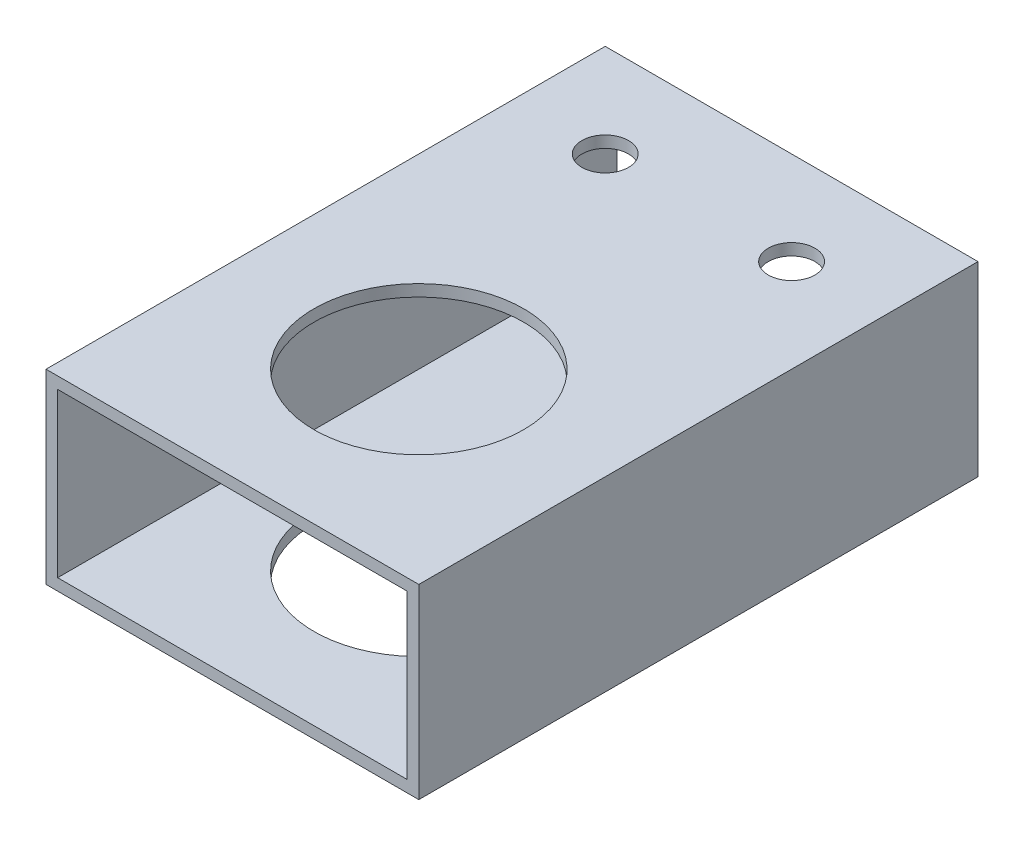
ISO-10303-21;
HEADER;
FILE_DESCRIPTION(('STEP AP214'),'2;1');
FILE_NAME('part.step','',(''),(''),'','','');
FILE_SCHEMA(('AUTOMOTIVE_DESIGN { 1 0 10303 214 1 1 1 1 }'));
ENDSEC;
DATA;
#1=APPLICATION_CONTEXT('core data for automotive mechanical design processes');
#2=APPLICATION_PROTOCOL_DEFINITION('international standard','automotive_design',2000,#1);
#3=PRODUCT_CONTEXT('',#1,'mechanical');
#4=PRODUCT('Part','Part','',(#3));
#5=PRODUCT_RELATED_PRODUCT_CATEGORY('part','',(#4));
#6=PRODUCT_DEFINITION_FORMATION('','',#4);
#7=PRODUCT_DEFINITION_CONTEXT('part definition',#1,'design');
#8=PRODUCT_DEFINITION('design','',#6,#7);
#9=PRODUCT_DEFINITION_SHAPE('','',#8);
#10=(LENGTH_UNIT() NAMED_UNIT(*) SI_UNIT(.MILLI.,.METRE.));
#11=(NAMED_UNIT(*) PLANE_ANGLE_UNIT() SI_UNIT($,.RADIAN.));
#12=(NAMED_UNIT(*) SI_UNIT($,.STERADIAN.) SOLID_ANGLE_UNIT());
#13=UNCERTAINTY_MEASURE_WITH_UNIT(LENGTH_MEASURE(1.E-05),#10,'distance_accuracy_value','');
#14=(GEOMETRIC_REPRESENTATION_CONTEXT(3) GLOBAL_UNCERTAINTY_ASSIGNED_CONTEXT((#13)) GLOBAL_UNIT_ASSIGNED_CONTEXT((#10,
#11,#12)) REPRESENTATION_CONTEXT('',''));
#15=CARTESIAN_POINT('',(0.,0.,0.));
#16=DIRECTION('',(0.,0.,1.));
#17=DIRECTION('',(1.,0.,0.));
#18=AXIS2_PLACEMENT_3D('',#15,#16,#17);
#19=CARTESIAN_POINT('',(0.,0.,76.2));
#20=DIRECTION('',(0.,0.,1.));
#21=DIRECTION('',(1.,0.,0.));
#22=AXIS2_PLACEMENT_3D('',#19,#20,#21);
#23=PLANE('',#22);
#24=DIRECTION('',(0.,-1.,0.));
#25=VECTOR('',#24,1.);
#26=CARTESIAN_POINT('',(-25.4,-12.7,76.2));
#27=LINE('',#26,#25);
#28=CARTESIAN_POINT('',(-25.4,12.7,76.2));
#29=VERTEX_POINT('',#28);
#30=CARTESIAN_POINT('',(-25.4,-12.7,76.2));
#31=VERTEX_POINT('',#30);
#32=EDGE_CURVE('E138',#29,#31,#27,.T.);
#33=ORIENTED_EDGE('',*,*,#32,.T.);
#34=DIRECTION('',(1.,0.,0.));
#35=VECTOR('',#34,1.);
#36=CARTESIAN_POINT('',(25.4,-12.7,76.2));
#37=LINE('',#36,#35);
#38=CARTESIAN_POINT('',(25.4,-12.7,76.2));
#39=VERTEX_POINT('',#38);
#40=EDGE_CURVE('E141',#31,#39,#37,.T.);
#41=ORIENTED_EDGE('',*,*,#40,.T.);
#42=DIRECTION('',(0.,1.,0.));
#43=VECTOR('',#42,1.);
#44=CARTESIAN_POINT('',(25.4,-12.7,76.2));
#45=LINE('',#44,#43);
#46=CARTESIAN_POINT('',(25.4,12.7,76.2));
#47=VERTEX_POINT('',#46);
#48=EDGE_CURVE('E144',#39,#47,#45,.T.);
#49=ORIENTED_EDGE('',*,*,#48,.T.);
#50=DIRECTION('',(-1.,0.,0.));
#51=VECTOR('',#50,1.);
#52=CARTESIAN_POINT('',(25.4,12.7,76.2));
#53=LINE('',#52,#51);
#54=EDGE_CURVE('E146',#47,#29,#53,.T.);
#55=ORIENTED_EDGE('',*,*,#54,.T.);
#56=EDGE_LOOP('',(#33,#41,#49,#55));
#57=FACE_BOUND('',#56,.T.);
#58=DIRECTION('',(1.,0.,0.));
#59=VECTOR('',#58,1.);
#60=CARTESIAN_POINT('',(23.8125,-11.1125,76.2));
#61=LINE('',#60,#59);
#62=CARTESIAN_POINT('',(-23.8125,-11.1125,76.2));
#63=VERTEX_POINT('',#62);
#64=CARTESIAN_POINT('',(23.8125,-11.1125,76.2));
#65=VERTEX_POINT('',#64);
#66=EDGE_CURVE('E108',#63,#65,#61,.T.);
#67=ORIENTED_EDGE('',*,*,#66,.F.);
#68=DIRECTION('',(0.,-1.,0.));
#69=VECTOR('',#68,1.);
#70=CARTESIAN_POINT('',(-23.8125,-11.1125,76.2));
#71=LINE('',#70,#69);
#72=CARTESIAN_POINT('',(-23.8125,11.1125,76.2));
#73=VERTEX_POINT('',#72);
#74=EDGE_CURVE('E100',#73,#63,#71,.T.);
#75=ORIENTED_EDGE('',*,*,#74,.F.);
#76=DIRECTION('',(-1.,0.,0.));
#77=VECTOR('',#76,1.);
#78=CARTESIAN_POINT('',(23.8125,11.1125,76.2));
#79=LINE('',#78,#77);
#80=CARTESIAN_POINT('',(23.8125,11.1125,76.2));
#81=VERTEX_POINT('',#80);
#82=EDGE_CURVE('E122',#81,#73,#79,.T.);
#83=ORIENTED_EDGE('',*,*,#82,.F.);
#84=DIRECTION('',(0.,1.,0.));
#85=VECTOR('',#84,1.);
#86=CARTESIAN_POINT('',(23.8125,-11.1125,76.2));
#87=LINE('',#86,#85);
#88=EDGE_CURVE('E120',#65,#81,#87,.T.);
#89=ORIENTED_EDGE('',*,*,#88,.F.);
#90=EDGE_LOOP('',(#67,#75,#83,#89));
#91=FACE_BOUND('',#90,.T.);
#92=ADVANCED_FACE('F33',(#57,#91),#23,.T.);
#93=CARTESIAN_POINT('',(0.,0.,0.));
#94=DIRECTION('',(0.,0.,1.));
#95=DIRECTION('',(1.,0.,0.));
#96=AXIS2_PLACEMENT_3D('',#93,#94,#95);
#97=PLANE('',#96);
#98=DIRECTION('',(0.,-1.,0.));
#99=VECTOR('',#98,1.);
#100=CARTESIAN_POINT('',(-25.4,-12.7,0.));
#101=LINE('',#100,#99);
#102=CARTESIAN_POINT('',(-25.4,12.7,0.));
#103=VERTEX_POINT('',#102);
#104=CARTESIAN_POINT('',(-25.4,-12.7,0.));
#105=VERTEX_POINT('',#104);
#106=EDGE_CURVE('E116',#103,#105,#101,.T.);
#107=ORIENTED_EDGE('',*,*,#106,.F.);
#108=DIRECTION('',(-1.,0.,0.));
#109=VECTOR('',#108,1.);
#110=CARTESIAN_POINT('',(25.4,12.7,0.));
#111=LINE('',#110,#109);
#112=CARTESIAN_POINT('',(25.4,12.7,0.));
#113=VERTEX_POINT('',#112);
#114=EDGE_CURVE('E142',#113,#103,#111,.T.);
#115=ORIENTED_EDGE('',*,*,#114,.F.);
#116=DIRECTION('',(0.,1.,0.));
#117=VECTOR('',#116,1.);
#118=CARTESIAN_POINT('',(25.4,-12.7,0.));
#119=LINE('',#118,#117);
#120=CARTESIAN_POINT('',(25.4,-12.7,0.));
#121=VERTEX_POINT('',#120);
#122=EDGE_CURVE('E153',#121,#113,#119,.T.);
#123=ORIENTED_EDGE('',*,*,#122,.F.);
#124=DIRECTION('',(1.,0.,0.));
#125=VECTOR('',#124,1.);
#126=CARTESIAN_POINT('',(25.4,-12.7,0.));
#127=LINE('',#126,#125);
#128=EDGE_CURVE('E151',#105,#121,#127,.T.);
#129=ORIENTED_EDGE('',*,*,#128,.F.);
#130=EDGE_LOOP('',(#107,#115,#123,#129));
#131=FACE_BOUND('',#130,.T.);
#132=DIRECTION('',(0.,-1.,0.));
#133=VECTOR('',#132,1.);
#134=CARTESIAN_POINT('',(-23.8125,-11.1125,0.));
#135=LINE('',#134,#133);
#136=CARTESIAN_POINT('',(-23.8125,11.1125,0.));
#137=VERTEX_POINT('',#136);
#138=CARTESIAN_POINT('',(-23.8125,-11.1125,0.));
#139=VERTEX_POINT('',#138);
#140=EDGE_CURVE('E58',#137,#139,#135,.T.);
#141=ORIENTED_EDGE('',*,*,#140,.T.);
#142=DIRECTION('',(1.,0.,0.));
#143=VECTOR('',#142,1.);
#144=CARTESIAN_POINT('',(23.8125,-11.1125,0.));
#145=LINE('',#144,#143);
#146=CARTESIAN_POINT('',(23.8125,-11.1125,0.));
#147=VERTEX_POINT('',#146);
#148=EDGE_CURVE('E115',#139,#147,#145,.T.);
#149=ORIENTED_EDGE('',*,*,#148,.T.);
#150=DIRECTION('',(0.,1.,0.));
#151=VECTOR('',#150,1.);
#152=CARTESIAN_POINT('',(23.8125,-11.1125,0.));
#153=LINE('',#152,#151);
#154=CARTESIAN_POINT('',(23.8125,11.1125,0.));
#155=VERTEX_POINT('',#154);
#156=EDGE_CURVE('E130',#147,#155,#153,.T.);
#157=ORIENTED_EDGE('',*,*,#156,.T.);
#158=DIRECTION('',(-1.,0.,0.));
#159=VECTOR('',#158,1.);
#160=CARTESIAN_POINT('',(23.8125,11.1125,0.));
#161=LINE('',#160,#159);
#162=EDGE_CURVE('E109',#155,#137,#161,.T.);
#163=ORIENTED_EDGE('',*,*,#162,.T.);
#164=EDGE_LOOP('',(#141,#149,#157,#163));
#165=FACE_BOUND('',#164,.T.);
#166=ADVANCED_FACE('F217',(#131,#165),#97,.F.);
#167=CARTESIAN_POINT('',(-25.4,-12.7,76.2));
#168=DIRECTION('',(1.,0.,0.));
#169=DIRECTION('',(0.,0.,-1.));
#170=AXIS2_PLACEMENT_3D('',#167,#168,#169);
#171=PLANE('',#170);
#172=ORIENTED_EDGE('',*,*,#106,.T.);
#173=DIRECTION('',(0.,0.,-1.));
#174=VECTOR('',#173,1.);
#175=CARTESIAN_POINT('',(-25.4,-12.7,76.2));
#176=LINE('',#175,#174);
#177=EDGE_CURVE('E11',#31,#105,#176,.T.);
#178=ORIENTED_EDGE('',*,*,#177,.F.);
#179=ORIENTED_EDGE('',*,*,#32,.F.);
#180=DIRECTION('',(0.,0.,-1.));
#181=VECTOR('',#180,1.);
#182=CARTESIAN_POINT('',(-25.4,12.7,76.2));
#183=LINE('',#182,#181);
#184=EDGE_CURVE('E148',#29,#103,#183,.T.);
#185=ORIENTED_EDGE('',*,*,#184,.T.);
#186=EDGE_LOOP('',(#172,#178,#179,#185));
#187=FACE_BOUND('',#186,.T.);
#188=ADVANCED_FACE('F35',(#187),#171,.F.);
#189=CARTESIAN_POINT('',(25.4,-12.7,76.2));
#190=DIRECTION('',(0.,1.,0.));
#191=DIRECTION('',(-1.,0.,0.));
#192=AXIS2_PLACEMENT_3D('',#189,#190,#191);
#193=PLANE('',#192);
#194=CARTESIAN_POINT('',(-12.7,-12.7,12.7));
#195=DIRECTION('',(0.,1.,0.));
#196=DIRECTION('',(-1.,0.,0.));
#197=AXIS2_PLACEMENT_3D('',#194,#195,#196);
#198=CIRCLE('',#197,3.175);
#199=CARTESIAN_POINT('',(-15.875,-12.7,12.7));
#200=VERTEX_POINT('',#199);
#201=EDGE_CURVE('E180',#200,#200,#198,.T.);
#202=ORIENTED_EDGE('',*,*,#201,.T.);
#203=EDGE_LOOP('',(#202));
#204=FACE_BOUND('',#203,.T.);
#205=CARTESIAN_POINT('',(12.7,-12.7,12.7));
#206=DIRECTION('',(0.,1.,0.));
#207=DIRECTION('',(-1.,0.,0.));
#208=AXIS2_PLACEMENT_3D('',#205,#206,#207);
#209=CIRCLE('',#208,3.175);
#210=CARTESIAN_POINT('',(9.525,-12.7,12.7));
#211=VERTEX_POINT('',#210);
#212=EDGE_CURVE('E169',#211,#211,#209,.T.);
#213=ORIENTED_EDGE('',*,*,#212,.T.);
#214=EDGE_LOOP('',(#213));
#215=FACE_BOUND('',#214,.T.);
#216=CARTESIAN_POINT('',(0.,-12.7,50.8));
#217=DIRECTION('',(0.,-1.,0.));
#218=DIRECTION('',(1.,0.,0.));
#219=AXIS2_PLACEMENT_3D('',#216,#217,#218);
#220=CIRCLE('',#219,14.2875);
#221=CARTESIAN_POINT('',(14.2875,-12.7,50.8));
#222=VERTEX_POINT('',#221);
#223=EDGE_CURVE('E189',#222,#222,#220,.T.);
#224=ORIENTED_EDGE('',*,*,#223,.F.);
#225=EDGE_LOOP('',(#224));
#226=FACE_BOUND('',#225,.T.);
#227=ORIENTED_EDGE('',*,*,#128,.T.);
#228=DIRECTION('',(0.,0.,-1.));
#229=VECTOR('',#228,1.);
#230=CARTESIAN_POINT('',(25.4,-12.7,76.2));
#231=LINE('',#230,#229);
#232=EDGE_CURVE('E42',#39,#121,#231,.T.);
#233=ORIENTED_EDGE('',*,*,#232,.F.);
#234=ORIENTED_EDGE('',*,*,#40,.F.);
#235=ORIENTED_EDGE('',*,*,#177,.T.);
#236=EDGE_LOOP('',(#227,#233,#234,#235));
#237=FACE_BOUND('',#236,.T.);
#238=ADVANCED_FACE('F230',(#204,#215,#226,#237),#193,.F.);
#239=CARTESIAN_POINT('',(25.4,-12.7,76.2));
#240=DIRECTION('',(-1.,0.,0.));
#241=DIRECTION('',(0.,0.,1.));
#242=AXIS2_PLACEMENT_3D('',#239,#240,#241);
#243=PLANE('',#242);
#244=ORIENTED_EDGE('',*,*,#122,.T.);
#245=DIRECTION('',(0.,0.,-1.));
#246=VECTOR('',#245,1.);
#247=CARTESIAN_POINT('',(25.4,12.7,76.2));
#248=LINE('',#247,#246);
#249=EDGE_CURVE('E158',#47,#113,#248,.T.);
#250=ORIENTED_EDGE('',*,*,#249,.F.);
#251=ORIENTED_EDGE('',*,*,#48,.F.);
#252=ORIENTED_EDGE('',*,*,#232,.T.);
#253=EDGE_LOOP('',(#244,#250,#251,#252));
#254=FACE_BOUND('',#253,.T.);
#255=ADVANCED_FACE('F227',(#254),#243,.F.);
#256=CARTESIAN_POINT('',(25.4,12.7,76.2));
#257=DIRECTION('',(0.,-1.,0.));
#258=DIRECTION('',(1.,0.,0.));
#259=AXIS2_PLACEMENT_3D('',#256,#257,#258);
#260=PLANE('',#259);
#261=CARTESIAN_POINT('',(-12.7,12.7,12.7));
#262=DIRECTION('',(0.,1.,0.));
#263=DIRECTION('',(-1.,0.,0.));
#264=AXIS2_PLACEMENT_3D('',#261,#262,#263);
#265=CIRCLE('',#264,3.175);
#266=CARTESIAN_POINT('',(-15.875,12.7,12.7));
#267=VERTEX_POINT('',#266);
#268=EDGE_CURVE('E183',#267,#267,#265,.T.);
#269=ORIENTED_EDGE('',*,*,#268,.F.);
#270=EDGE_LOOP('',(#269));
#271=FACE_BOUND('',#270,.T.);
#272=CARTESIAN_POINT('',(12.7,12.7,12.7));
#273=DIRECTION('',(0.,1.,0.));
#274=DIRECTION('',(-1.,0.,0.));
#275=AXIS2_PLACEMENT_3D('',#272,#273,#274);
#276=CIRCLE('',#275,3.175);
#277=CARTESIAN_POINT('',(9.525,12.7,12.7));
#278=VERTEX_POINT('',#277);
#279=EDGE_CURVE('E175',#278,#278,#276,.T.);
#280=ORIENTED_EDGE('',*,*,#279,.F.);
#281=EDGE_LOOP('',(#280));
#282=FACE_BOUND('',#281,.T.);
#283=CARTESIAN_POINT('',(0.,12.7,50.8));
#284=DIRECTION('',(0.,-1.,0.));
#285=DIRECTION('',(1.,0.,0.));
#286=AXIS2_PLACEMENT_3D('',#283,#284,#285);
#287=CIRCLE('',#286,14.2875);
#288=CARTESIAN_POINT('',(14.2875,12.7,50.8));
#289=VERTEX_POINT('',#288);
#290=EDGE_CURVE('E165',#289,#289,#287,.T.);
#291=ORIENTED_EDGE('',*,*,#290,.T.);
#292=EDGE_LOOP('',(#291));
#293=FACE_BOUND('',#292,.T.);
#294=ORIENTED_EDGE('',*,*,#114,.T.);
#295=ORIENTED_EDGE('',*,*,#184,.F.);
#296=ORIENTED_EDGE('',*,*,#54,.F.);
#297=ORIENTED_EDGE('',*,*,#249,.T.);
#298=EDGE_LOOP('',(#294,#295,#296,#297));
#299=FACE_BOUND('',#298,.T.);
#300=ADVANCED_FACE('F212',(#271,#282,#293,#299),#260,.F.);
#301=CARTESIAN_POINT('',(-23.8125,-11.1125,76.2));
#302=DIRECTION('',(1.,0.,0.));
#303=DIRECTION('',(0.,0.,-1.));
#304=AXIS2_PLACEMENT_3D('',#301,#302,#303);
#305=PLANE('',#304);
#306=ORIENTED_EDGE('',*,*,#140,.F.);
#307=DIRECTION('',(0.,0.,-1.));
#308=VECTOR('',#307,1.);
#309=CARTESIAN_POINT('',(-23.8125,11.1125,76.2));
#310=LINE('',#309,#308);
#311=EDGE_CURVE('E104',#73,#137,#310,.T.);
#312=ORIENTED_EDGE('',*,*,#311,.F.);
#313=ORIENTED_EDGE('',*,*,#74,.T.);
#314=DIRECTION('',(0.,0.,-1.));
#315=VECTOR('',#314,1.);
#316=CARTESIAN_POINT('',(-23.8125,-11.1125,76.2));
#317=LINE('',#316,#315);
#318=EDGE_CURVE('E103',#63,#139,#317,.T.);
#319=ORIENTED_EDGE('',*,*,#318,.T.);
#320=EDGE_LOOP('',(#306,#312,#313,#319));
#321=FACE_BOUND('',#320,.T.);
#322=ADVANCED_FACE('F102',(#321),#305,.T.);
#323=CARTESIAN_POINT('',(23.8125,-11.1125,76.2));
#324=DIRECTION('',(0.,1.,0.));
#325=DIRECTION('',(-1.,0.,0.));
#326=AXIS2_PLACEMENT_3D('',#323,#324,#325);
#327=PLANE('',#326);
#328=CARTESIAN_POINT('',(-12.7,-11.1125,12.7));
#329=DIRECTION('',(0.,1.,0.));
#330=DIRECTION('',(-1.,0.,0.));
#331=AXIS2_PLACEMENT_3D('',#328,#329,#330);
#332=CIRCLE('',#331,3.175);
#333=CARTESIAN_POINT('',(-15.875,-11.1125,12.7));
#334=VERTEX_POINT('',#333);
#335=EDGE_CURVE('E186',#334,#334,#332,.T.);
#336=ORIENTED_EDGE('',*,*,#335,.F.);
#337=EDGE_LOOP('',(#336));
#338=FACE_BOUND('',#337,.T.);
#339=CARTESIAN_POINT('',(12.7,-11.1125,12.7));
#340=DIRECTION('',(0.,1.,0.));
#341=DIRECTION('',(-1.,0.,0.));
#342=AXIS2_PLACEMENT_3D('',#339,#340,#341);
#343=CIRCLE('',#342,3.175);
#344=CARTESIAN_POINT('',(9.525,-11.1125,12.7));
#345=VERTEX_POINT('',#344);
#346=EDGE_CURVE('E168',#345,#345,#343,.T.);
#347=ORIENTED_EDGE('',*,*,#346,.F.);
#348=EDGE_LOOP('',(#347));
#349=FACE_BOUND('',#348,.T.);
#350=CARTESIAN_POINT('',(0.,-11.1125,50.8));
#351=DIRECTION('',(0.,1.,0.));
#352=DIRECTION('',(-1.,0.,0.));
#353=AXIS2_PLACEMENT_3D('',#350,#351,#352);
#354=CIRCLE('',#353,14.2875);
#355=CARTESIAN_POINT('',(-14.2875,-11.1125,50.8));
#356=VERTEX_POINT('',#355);
#357=EDGE_CURVE('E128',#356,#356,#354,.T.);
#358=ORIENTED_EDGE('',*,*,#357,.F.);
#359=EDGE_LOOP('',(#358));
#360=FACE_BOUND('',#359,.T.);
#361=ORIENTED_EDGE('',*,*,#148,.F.);
#362=ORIENTED_EDGE('',*,*,#318,.F.);
#363=ORIENTED_EDGE('',*,*,#66,.T.);
#364=DIRECTION('',(0.,0.,-1.));
#365=VECTOR('',#364,1.);
#366=CARTESIAN_POINT('',(23.8125,-11.1125,76.2));
#367=LINE('',#366,#365);
#368=EDGE_CURVE('E117',#65,#147,#367,.T.);
#369=ORIENTED_EDGE('',*,*,#368,.T.);
#370=EDGE_LOOP('',(#361,#362,#363,#369));
#371=FACE_BOUND('',#370,.T.);
#372=ADVANCED_FACE('F112',(#338,#349,#360,#371),#327,.T.);
#373=CARTESIAN_POINT('',(23.8125,-11.1125,76.2));
#374=DIRECTION('',(-1.,0.,0.));
#375=DIRECTION('',(0.,0.,1.));
#376=AXIS2_PLACEMENT_3D('',#373,#374,#375);
#377=PLANE('',#376);
#378=ORIENTED_EDGE('',*,*,#156,.F.);
#379=ORIENTED_EDGE('',*,*,#368,.F.);
#380=ORIENTED_EDGE('',*,*,#88,.T.);
#381=DIRECTION('',(0.,0.,-1.));
#382=VECTOR('',#381,1.);
#383=CARTESIAN_POINT('',(23.8125,11.1125,76.2));
#384=LINE('',#383,#382);
#385=EDGE_CURVE('E50',#81,#155,#384,.T.);
#386=ORIENTED_EDGE('',*,*,#385,.T.);
#387=EDGE_LOOP('',(#378,#379,#380,#386));
#388=FACE_BOUND('',#387,.T.);
#389=ADVANCED_FACE('F200',(#388),#377,.T.);
#390=CARTESIAN_POINT('',(23.8125,11.1125,76.2));
#391=DIRECTION('',(0.,-1.,0.));
#392=DIRECTION('',(1.,0.,0.));
#393=AXIS2_PLACEMENT_3D('',#390,#391,#392);
#394=PLANE('',#393);
#395=CARTESIAN_POINT('',(-12.7,11.1125,12.7));
#396=DIRECTION('',(0.,-1.,0.));
#397=DIRECTION('',(1.,0.,0.));
#398=AXIS2_PLACEMENT_3D('',#395,#396,#397);
#399=CIRCLE('',#398,3.175);
#400=CARTESIAN_POINT('',(-9.525,11.1125,12.7));
#401=VERTEX_POINT('',#400);
#402=EDGE_CURVE('E37',#401,#401,#399,.T.);
#403=ORIENTED_EDGE('',*,*,#402,.F.);
#404=EDGE_LOOP('',(#403));
#405=FACE_BOUND('',#404,.T.);
#406=CARTESIAN_POINT('',(12.7,11.1125,12.7));
#407=DIRECTION('',(0.,-1.,0.));
#408=DIRECTION('',(1.,0.,0.));
#409=AXIS2_PLACEMENT_3D('',#406,#407,#408);
#410=CIRCLE('',#409,3.175);
#411=CARTESIAN_POINT('',(15.875,11.1125,12.7));
#412=VERTEX_POINT('',#411);
#413=EDGE_CURVE('E166',#412,#412,#410,.T.);
#414=ORIENTED_EDGE('',*,*,#413,.F.);
#415=EDGE_LOOP('',(#414));
#416=FACE_BOUND('',#415,.T.);
#417=CARTESIAN_POINT('',(0.,11.1125,50.8));
#418=DIRECTION('',(0.,-1.,0.));
#419=DIRECTION('',(1.,0.,0.));
#420=AXIS2_PLACEMENT_3D('',#417,#418,#419);
#421=CIRCLE('',#420,14.2875);
#422=CARTESIAN_POINT('',(14.2875,11.1125,50.8));
#423=VERTEX_POINT('',#422);
#424=EDGE_CURVE('E163',#423,#423,#421,.T.);
#425=ORIENTED_EDGE('',*,*,#424,.F.);
#426=EDGE_LOOP('',(#425));
#427=FACE_BOUND('',#426,.T.);
#428=ORIENTED_EDGE('',*,*,#162,.F.);
#429=ORIENTED_EDGE('',*,*,#385,.F.);
#430=ORIENTED_EDGE('',*,*,#82,.T.);
#431=ORIENTED_EDGE('',*,*,#311,.T.);
#432=EDGE_LOOP('',(#428,#429,#430,#431));
#433=FACE_BOUND('',#432,.T.);
#434=ADVANCED_FACE('F208',(#405,#416,#427,#433),#394,.T.);
#435=CARTESIAN_POINT('',(0.,12.7,50.8));
#436=DIRECTION('',(0.,-1.,0.));
#437=DIRECTION('',(1.,0.,0.));
#438=AXIS2_PLACEMENT_3D('',#435,#436,#437);
#439=CYLINDRICAL_SURFACE('',#438,14.2875);
#440=ORIENTED_EDGE('',*,*,#424,.T.);
#441=EDGE_LOOP('',(#440));
#442=FACE_BOUND('',#441,.T.);
#443=ORIENTED_EDGE('',*,*,#290,.F.);
#444=EDGE_LOOP('',(#443));
#445=FACE_BOUND('',#444,.T.);
#446=ADVANCED_FACE('F257',(#442,#445),#439,.F.);
#447=ORIENTED_EDGE('',*,*,#357,.T.);
#448=EDGE_LOOP('',(#447));
#449=FACE_BOUND('',#448,.T.);
#450=ORIENTED_EDGE('',*,*,#223,.T.);
#451=EDGE_LOOP('',(#450));
#452=FACE_BOUND('',#451,.T.);
#453=ADVANCED_FACE('F196',(#449,#452),#439,.F.);
#454=CARTESIAN_POINT('',(12.7,-12.7,12.7));
#455=DIRECTION('',(0.,1.,0.));
#456=DIRECTION('',(-1.,0.,0.));
#457=AXIS2_PLACEMENT_3D('',#454,#455,#456);
#458=CYLINDRICAL_SURFACE('',#457,3.175);
#459=ORIENTED_EDGE('',*,*,#413,.T.);
#460=EDGE_LOOP('',(#459));
#461=FACE_BOUND('',#460,.T.);
#462=ORIENTED_EDGE('',*,*,#279,.T.);
#463=EDGE_LOOP('',(#462));
#464=FACE_BOUND('',#463,.T.);
#465=ADVANCED_FACE('F269',(#461,#464),#458,.F.);
#466=CARTESIAN_POINT('',(-12.7,-12.7,12.7));
#467=DIRECTION('',(0.,1.,0.));
#468=DIRECTION('',(-1.,0.,0.));
#469=AXIS2_PLACEMENT_3D('',#466,#467,#468);
#470=CYLINDRICAL_SURFACE('',#469,3.175);
#471=ORIENTED_EDGE('',*,*,#402,.T.);
#472=EDGE_LOOP('',(#471));
#473=FACE_BOUND('',#472,.T.);
#474=ORIENTED_EDGE('',*,*,#268,.T.);
#475=EDGE_LOOP('',(#474));
#476=FACE_BOUND('',#475,.T.);
#477=ADVANCED_FACE('F272',(#473,#476),#470,.F.);
#478=ORIENTED_EDGE('',*,*,#346,.T.);
#479=EDGE_LOOP('',(#478));
#480=FACE_BOUND('',#479,.T.);
#481=ORIENTED_EDGE('',*,*,#212,.F.);
#482=EDGE_LOOP('',(#481));
#483=FACE_BOUND('',#482,.T.);
#484=ADVANCED_FACE('F273',(#480,#483),#458,.F.);
#485=ORIENTED_EDGE('',*,*,#335,.T.);
#486=EDGE_LOOP('',(#485));
#487=FACE_BOUND('',#486,.T.);
#488=ORIENTED_EDGE('',*,*,#201,.F.);
#489=EDGE_LOOP('',(#488));
#490=FACE_BOUND('',#489,.T.);
#491=ADVANCED_FACE('F276',(#487,#490),#470,.F.);
#492=CLOSED_SHELL('',(#92,#166,#188,#238,#255,#300,#322,#372,#389,#434,#446,#453,#465,#477,#484,#491));
#493=MANIFOLD_SOLID_BREP('B2',#492);
#494=ADVANCED_BREP_SHAPE_REPRESENTATION('',(#18,#493),#14);
#495=SHAPE_DEFINITION_REPRESENTATION(#9,#494);
ENDSEC;
END-ISO-10303-21;
